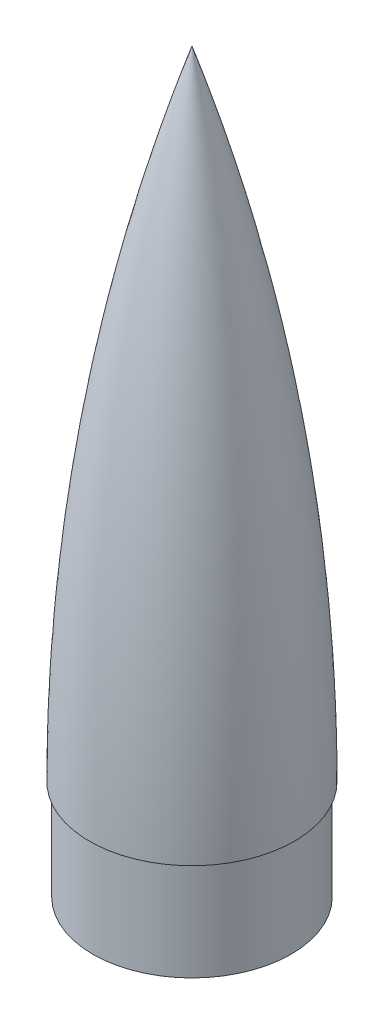
ISO-10303-21;
HEADER;
FILE_DESCRIPTION(('STEP AP214'),'2;1');
FILE_NAME('part.step','',(''),(''),'','','');
FILE_SCHEMA(('AUTOMOTIVE_DESIGN { 1 0 10303 214 1 1 1 1 }'));
ENDSEC;
DATA;
#1=APPLICATION_CONTEXT('core data for automotive mechanical design processes');
#2=APPLICATION_PROTOCOL_DEFINITION('international standard','automotive_design',2000,#1);
#3=PRODUCT_CONTEXT('',#1,'mechanical');
#4=PRODUCT('Part','Part','',(#3));
#5=PRODUCT_RELATED_PRODUCT_CATEGORY('part','',(#4));
#6=PRODUCT_DEFINITION_FORMATION('','',#4);
#7=PRODUCT_DEFINITION_CONTEXT('part definition',#1,'design');
#8=PRODUCT_DEFINITION('design','',#6,#7);
#9=PRODUCT_DEFINITION_SHAPE('','',#8);
#10=(LENGTH_UNIT() NAMED_UNIT(*) SI_UNIT(.MILLI.,.METRE.));
#11=(NAMED_UNIT(*) PLANE_ANGLE_UNIT() SI_UNIT($,.RADIAN.));
#12=(NAMED_UNIT(*) SI_UNIT($,.STERADIAN.) SOLID_ANGLE_UNIT());
#13=UNCERTAINTY_MEASURE_WITH_UNIT(LENGTH_MEASURE(1.E-05),#10,'distance_accuracy_value','');
#14=(GEOMETRIC_REPRESENTATION_CONTEXT(3) GLOBAL_UNCERTAINTY_ASSIGNED_CONTEXT((#13)) GLOBAL_UNIT_ASSIGNED_CONTEXT((#10,
#11,#12)) REPRESENTATION_CONTEXT('',''));
#15=CARTESIAN_POINT('',(0.,0.,0.));
#16=DIRECTION('',(0.,0.,1.));
#17=DIRECTION('',(1.,0.,0.));
#18=AXIS2_PLACEMENT_3D('',#15,#16,#17);
#19=CARTESIAN_POINT('',(-1229.8934,0.,1229.8934));
#20=DIRECTION('',(-1.,0.,0.));
#21=DIRECTION('',(0.,0.,-1.));
#22=AXIS2_PLACEMENT_3D('',#19,#20,#21);
#23=CIRCLE('',#22,1295.2984);
#24=TRIMMED_CURVE('',#23,(PARAMETER_VALUE(-0.319139205316949)),
(PARAMETER_VALUE(0.319139205316949)),.T.,.PARAMETER.);
#25=CARTESIAN_POINT('',(-1229.8934,0.,0.));
#26=DIRECTION('',(0.,-1.,0.));
#27=AXIS1_PLACEMENT('',#25,#26);
#28=SURFACE_OF_REVOLUTION('',#24,#27);
#29=CARTESIAN_POINT('',(-1229.8934,0.,0.));
#30=DIRECTION('',(0.,-1.,0.));
#31=DIRECTION('',(0.,0.,-1.));
#32=AXIS2_PLACEMENT_3D('',#29,#30,#31);
#33=CIRCLE('',#32,65.4049999999999);
#34=CARTESIAN_POINT('',(-1229.8934,0.,-65.4049999999999));
#35=VERTEX_POINT('',#34);
#36=EDGE_CURVE('E40',#35,#35,#33,.T.);
#37=ORIENTED_EDGE('',*,*,#36,.F.);
#38=EDGE_LOOP('',(#37));
#39=FACE_BOUND('',#38,.T.);
#40=CARTESIAN_POINT('',(-1229.8934,406.399027655087,0.));
#41=VERTEX_POINT('',#40);
#42=VERTEX_LOOP('',#41);
#43=FACE_BOUND('',#42,.T.);
#44=ADVANCED_FACE('F37',(#39,#43),#28,.T.);
#45=CARTESIAN_POINT('',(-1295.2984,0.,0.));
#46=DIRECTION('',(0.,1.,0.));
#47=DIRECTION('',(0.,0.,1.));
#48=AXIS2_PLACEMENT_3D('',#45,#46,#47);
#49=PLANE('',#48);
#50=CARTESIAN_POINT('',(-1229.8934,0.,0.));
#51=DIRECTION('',(0.,-1.,0.));
#52=DIRECTION('',(0.,0.,-1.));
#53=AXIS2_PLACEMENT_3D('',#50,#51,#52);
#54=CIRCLE('',#53,63.2459999999999);
#55=CARTESIAN_POINT('',(-1229.8934,0.,-63.2459999999999));
#56=VERTEX_POINT('',#55);
#57=EDGE_CURVE('E11',#56,#56,#54,.T.);
#58=ORIENTED_EDGE('',*,*,#57,.F.);
#59=EDGE_LOOP('',(#58));
#60=FACE_BOUND('',#59,.T.);
#61=ORIENTED_EDGE('',*,*,#36,.T.);
#62=EDGE_LOOP('',(#61));
#63=FACE_BOUND('',#62,.T.);
#64=ADVANCED_FACE('F67',(#60,#63),#49,.F.);
#65=CARTESIAN_POINT('',(-1229.8934,-63.5,0.));
#66=DIRECTION('',(0.,-1.,0.));
#67=DIRECTION('',(0.,0.,-1.));
#68=AXIS2_PLACEMENT_3D('',#65,#66,#67);
#69=PLANE('',#68);
#70=CARTESIAN_POINT('',(-1229.8934,-63.5,0.));
#71=DIRECTION('',(0.,-1.,0.));
#72=DIRECTION('',(0.,0.,-1.));
#73=AXIS2_PLACEMENT_3D('',#70,#71,#72);
#74=CIRCLE('',#73,63.2459999999999);
#75=CARTESIAN_POINT('',(-1229.8934,-63.5,-63.2459999999999));
#76=VERTEX_POINT('',#75);
#77=EDGE_CURVE('E77',#76,#76,#74,.T.);
#78=ORIENTED_EDGE('',*,*,#77,.T.);
#79=EDGE_LOOP('',(#78));
#80=FACE_BOUND('',#79,.T.);
#81=CARTESIAN_POINT('',(-1229.8934,-63.5,0.));
#82=DIRECTION('',(0.,-1.,0.));
#83=DIRECTION('',(0.,0.,-1.));
#84=AXIS2_PLACEMENT_3D('',#81,#82,#83);
#85=CIRCLE('',#84,55.626);
#86=CARTESIAN_POINT('',(-1229.8934,-63.5,-55.626));
#87=VERTEX_POINT('',#86);
#88=EDGE_CURVE('E80',#87,#87,#85,.T.);
#89=ORIENTED_EDGE('',*,*,#88,.F.);
#90=EDGE_LOOP('',(#89));
#91=FACE_BOUND('',#90,.T.);
#92=ADVANCED_FACE('F71',(#80,#91),#69,.T.);
#93=CARTESIAN_POINT('',(-1229.8934,0.,0.));
#94=DIRECTION('',(0.,-1.,0.));
#95=DIRECTION('',(0.,0.,-1.));
#96=AXIS2_PLACEMENT_3D('',#93,#94,#95);
#97=PLANE('',#96);
#98=CARTESIAN_POINT('',(-1229.8934,0.,0.));
#99=DIRECTION('',(0.,1.,0.));
#100=DIRECTION('',(0.,0.,1.));
#101=AXIS2_PLACEMENT_3D('',#98,#99,#100);
#102=CIRCLE('',#101,57.785);
#103=CARTESIAN_POINT('',(-1229.8934,0.,57.785));
#104=VERTEX_POINT('',#103);
#105=EDGE_CURVE('E76',#104,#104,#102,.F.);
#106=ORIENTED_EDGE('',*,*,#105,.F.);
#107=EDGE_LOOP('',(#106));
#108=FACE_BOUND('',#107,.T.);
#109=CARTESIAN_POINT('',(-1229.8934,0.,0.));
#110=DIRECTION('',(0.,-1.,0.));
#111=DIRECTION('',(0.,0.,-1.));
#112=AXIS2_PLACEMENT_3D('',#109,#110,#111);
#113=CIRCLE('',#112,55.626);
#114=CARTESIAN_POINT('',(-1229.8934,0.,-55.626));
#115=VERTEX_POINT('',#114);
#116=EDGE_CURVE('E83',#115,#115,#113,.T.);
#117=ORIENTED_EDGE('',*,*,#116,.T.);
#118=EDGE_LOOP('',(#117));
#119=FACE_BOUND('',#118,.T.);
#120=ADVANCED_FACE('F91',(#108,#119),#97,.F.);
#121=CARTESIAN_POINT('',(-1229.8934,-63.5,0.));
#122=DIRECTION('',(0.,1.,0.));
#123=DIRECTION('',(0.,0.,1.));
#124=AXIS2_PLACEMENT_3D('',#121,#122,#123);
#125=CYLINDRICAL_SURFACE('',#124,63.2459999999999);
#126=ORIENTED_EDGE('',*,*,#77,.F.);
#127=EDGE_LOOP('',(#126));
#128=FACE_BOUND('',#127,.T.);
#129=ORIENTED_EDGE('',*,*,#57,.T.);
#130=EDGE_LOOP('',(#129));
#131=FACE_BOUND('',#130,.T.);
#132=ADVANCED_FACE('F61',(#128,#131),#125,.T.);
#133=CARTESIAN_POINT('',(-1229.8934,-63.5,0.));
#134=DIRECTION('',(0.,1.,0.));
#135=DIRECTION('',(0.,0.,1.));
#136=AXIS2_PLACEMENT_3D('',#133,#134,#135);
#137=CYLINDRICAL_SURFACE('',#136,55.626);
#138=ORIENTED_EDGE('',*,*,#88,.T.);
#139=EDGE_LOOP('',(#138));
#140=FACE_BOUND('',#139,.T.);
#141=ORIENTED_EDGE('',*,*,#116,.F.);
#142=EDGE_LOOP('',(#141));
#143=FACE_BOUND('',#142,.T.);
#144=ADVANCED_FACE('F53',(#140,#143),#137,.F.);
#145=CARTESIAN_POINT('',(-1229.8934,0.,1229.8934));
#146=DIRECTION('',(-1.,0.,0.));
#147=DIRECTION('',(0.,0.,-1.));
#148=AXIS2_PLACEMENT_3D('',#145,#146,#147);
#149=CIRCLE('',#148,1287.6784);
#150=TRIMMED_CURVE('',#149,(PARAMETER_VALUE(-0.300715956544868)),
(PARAMETER_VALUE(0.300715956544868)),.T.,.PARAMETER.);
#151=CARTESIAN_POINT('',(-1229.8934,0.,0.));
#152=DIRECTION('',(0.,-1.,0.));
#153=AXIS1_PLACEMENT('',#151,#152);
#154=SURFACE_OF_REVOLUTION('',#150,#153);
#155=ORIENTED_EDGE('',*,*,#105,.T.);
#156=EDGE_LOOP('',(#155));
#157=FACE_BOUND('',#156,.T.);
#158=CARTESIAN_POINT('',(-1229.8934,381.415634790972,0.));
#159=VERTEX_POINT('',#158);
#160=VERTEX_LOOP('',#159);
#161=FACE_BOUND('',#160,.T.);
#162=ADVANCED_FACE('F51',(#157,#161),#154,.F.);
#163=CLOSED_SHELL('',(#44,#64,#92,#120,#132,#144,#162));
#164=MANIFOLD_SOLID_BREP('B2',#163);
#165=ADVANCED_BREP_SHAPE_REPRESENTATION('',(#18,#164),#14);
#166=SHAPE_DEFINITION_REPRESENTATION(#9,#165);
ENDSEC;
END-ISO-10303-21;
